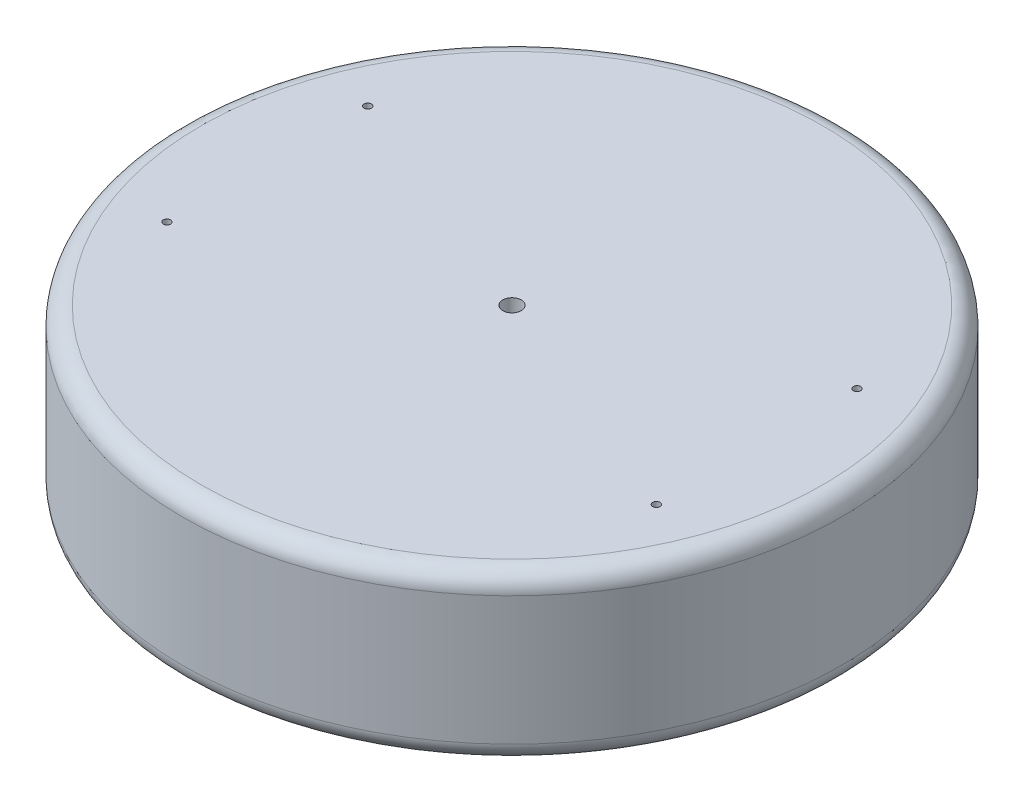
ISO-10303-21;
HEADER;
FILE_DESCRIPTION(('STEP AP214'),'2;1');
FILE_NAME('part.step','',(''),(''),'','','');
FILE_SCHEMA(('AUTOMOTIVE_DESIGN { 1 0 10303 214 1 1 1 1 }'));
ENDSEC;
DATA;
#1=APPLICATION_CONTEXT('core data for automotive mechanical design processes');
#2=APPLICATION_PROTOCOL_DEFINITION('international standard','automotive_design',2000,#1);
#3=PRODUCT_CONTEXT('',#1,'mechanical');
#4=PRODUCT('Part','Part','',(#3));
#5=PRODUCT_RELATED_PRODUCT_CATEGORY('part','',(#4));
#6=PRODUCT_DEFINITION_FORMATION('','',#4);
#7=PRODUCT_DEFINITION_CONTEXT('part definition',#1,'design');
#8=PRODUCT_DEFINITION('design','',#6,#7);
#9=PRODUCT_DEFINITION_SHAPE('','',#8);
#10=(LENGTH_UNIT() NAMED_UNIT(*) SI_UNIT(.MILLI.,.METRE.));
#11=(NAMED_UNIT(*) PLANE_ANGLE_UNIT() SI_UNIT($,.RADIAN.));
#12=(NAMED_UNIT(*) SI_UNIT($,.STERADIAN.) SOLID_ANGLE_UNIT());
#13=UNCERTAINTY_MEASURE_WITH_UNIT(LENGTH_MEASURE(1.E-05),#10,'distance_accuracy_value','');
#14=(GEOMETRIC_REPRESENTATION_CONTEXT(3) GLOBAL_UNCERTAINTY_ASSIGNED_CONTEXT((#13)) GLOBAL_UNIT_ASSIGNED_CONTEXT((#10,
#11,#12)) REPRESENTATION_CONTEXT('',''));
#15=CARTESIAN_POINT('',(0.,0.,0.));
#16=DIRECTION('',(0.,0.,1.));
#17=DIRECTION('',(1.,0.,0.));
#18=AXIS2_PLACEMENT_3D('',#15,#16,#17);
#19=CARTESIAN_POINT('',(0.,89.,0.));
#20=DIRECTION('',(0.,1.,0.));
#21=DIRECTION('',(0.,0.,1.));
#22=AXIS2_PLACEMENT_3D('',#19,#20,#21);
#23=PLANE('',#22);
#24=CARTESIAN_POINT('',(0.,89.,0.));
#25=DIRECTION('',(0.,1.,0.));
#26=DIRECTION('',(0.,0.,1.));
#27=AXIS2_PLACEMENT_3D('',#24,#25,#26);
#28=CIRCLE('',#27,167.);
#29=CARTESIAN_POINT('',(0.,89.,167.));
#30=VERTEX_POINT('',#29);
#31=EDGE_CURVE('E10',#30,#30,#28,.T.);
#32=ORIENTED_EDGE('',*,*,#31,.T.);
#33=EDGE_LOOP('',(#32));
#34=FACE_BOUND('',#33,.T.);
#35=CARTESIAN_POINT('',(-131.4,89.,53.9));
#36=DIRECTION('',(0.,1.,0.));
#37=DIRECTION('',(0.,0.,1.));
#38=AXIS2_PLACEMENT_3D('',#35,#36,#37);
#39=CIRCLE('',#38,1.97500000000001);
#40=CARTESIAN_POINT('',(-131.4,89.,55.875));
#41=VERTEX_POINT('',#40);
#42=EDGE_CURVE('E75',#41,#41,#39,.T.);
#43=ORIENTED_EDGE('',*,*,#42,.F.);
#44=EDGE_LOOP('',(#43));
#45=FACE_BOUND('',#44,.T.);
#46=CARTESIAN_POINT('',(131.4,89.,53.9));
#47=DIRECTION('',(0.,1.,0.));
#48=DIRECTION('',(0.,0.,-1.));
#49=AXIS2_PLACEMENT_3D('',#46,#47,#48);
#50=CIRCLE('',#49,1.97500000000001);
#51=CARTESIAN_POINT('',(131.4,89.,51.925));
#52=VERTEX_POINT('',#51);
#53=EDGE_CURVE('E69',#52,#52,#50,.T.);
#54=ORIENTED_EDGE('',*,*,#53,.F.);
#55=EDGE_LOOP('',(#54));
#56=FACE_BOUND('',#55,.T.);
#57=CARTESIAN_POINT('',(131.4,89.,-53.9));
#58=DIRECTION('',(0.,1.,0.));
#59=DIRECTION('',(0.,0.,-1.));
#60=AXIS2_PLACEMENT_3D('',#57,#58,#59);
#61=CIRCLE('',#60,1.97500000000001);
#62=CARTESIAN_POINT('',(131.4,89.,-55.875));
#63=VERTEX_POINT('',#62);
#64=EDGE_CURVE('E63',#63,#63,#61,.T.);
#65=ORIENTED_EDGE('',*,*,#64,.F.);
#66=EDGE_LOOP('',(#65));
#67=FACE_BOUND('',#66,.T.);
#68=CARTESIAN_POINT('',(-131.4,89.,-53.9));
#69=DIRECTION('',(0.,1.,0.));
#70=DIRECTION('',(0.,0.,1.));
#71=AXIS2_PLACEMENT_3D('',#68,#69,#70);
#72=CIRCLE('',#71,1.97500000000001);
#73=CARTESIAN_POINT('',(-131.4,89.,-51.925));
#74=VERTEX_POINT('',#73);
#75=EDGE_CURVE('E57',#74,#74,#72,.T.);
#76=ORIENTED_EDGE('',*,*,#75,.F.);
#77=EDGE_LOOP('',(#76));
#78=FACE_BOUND('',#77,.T.);
#79=CARTESIAN_POINT('',(0.,89.,0.));
#80=DIRECTION('',(0.,1.,0.));
#81=DIRECTION('',(0.,0.,1.));
#82=AXIS2_PLACEMENT_3D('',#79,#80,#81);
#83=CIRCLE('',#82,5.);
#84=CARTESIAN_POINT('',(0.,89.,5.));
#85=VERTEX_POINT('',#84);
#86=EDGE_CURVE('E50',#85,#85,#83,.T.);
#87=ORIENTED_EDGE('',*,*,#86,.F.);
#88=EDGE_LOOP('',(#87));
#89=FACE_BOUND('',#88,.T.);
#90=ADVANCED_FACE('F30',(#34,#45,#56,#67,#78,#89),#23,.T.);
#91=CARTESIAN_POINT('',(0.,0.,0.));
#92=DIRECTION('',(0.,1.,0.));
#93=DIRECTION('',(0.,0.,1.));
#94=AXIS2_PLACEMENT_3D('',#91,#92,#93);
#95=PLANE('',#94);
#96=CARTESIAN_POINT('',(0.,0.,0.));
#97=DIRECTION('',(0.,1.,0.));
#98=DIRECTION('',(0.,0.,1.));
#99=AXIS2_PLACEMENT_3D('',#96,#97,#98);
#100=CIRCLE('',#99,167.);
#101=CARTESIAN_POINT('',(0.,0.,167.));
#102=VERTEX_POINT('',#101);
#103=EDGE_CURVE('E37',#102,#102,#100,.F.);
#104=ORIENTED_EDGE('',*,*,#103,.T.);
#105=EDGE_LOOP('',(#104));
#106=FACE_BOUND('',#105,.T.);
#107=CARTESIAN_POINT('',(0.,0.,0.));
#108=DIRECTION('',(0.,1.,0.));
#109=DIRECTION('',(0.,0.,1.));
#110=AXIS2_PLACEMENT_3D('',#107,#108,#109);
#111=CIRCLE('',#110,5.);
#112=CARTESIAN_POINT('',(0.,0.,5.));
#113=VERTEX_POINT('',#112);
#114=EDGE_CURVE('E51',#113,#113,#111,.T.);
#115=ORIENTED_EDGE('',*,*,#114,.T.);
#116=EDGE_LOOP('',(#115));
#117=FACE_BOUND('',#116,.T.);
#118=ADVANCED_FACE('F92',(#106,#117),#95,.F.);
#119=CARTESIAN_POINT('',(0.,89.,0.));
#120=DIRECTION('',(0.,-1.,0.));
#121=DIRECTION('',(0.,0.,-1.));
#122=AXIS2_PLACEMENT_3D('',#119,#120,#121);
#123=CYLINDRICAL_SURFACE('',#122,177.);
#124=CARTESIAN_POINT('',(0.,9.99999999999999,0.));
#125=DIRECTION('',(0.,1.,0.));
#126=DIRECTION('',(0.,0.,1.));
#127=AXIS2_PLACEMENT_3D('',#124,#125,#126);
#128=CIRCLE('',#127,177.);
#129=CARTESIAN_POINT('',(0.,9.99999999999999,177.));
#130=VERTEX_POINT('',#129);
#131=EDGE_CURVE('E41',#130,#130,#128,.T.);
#132=ORIENTED_EDGE('',*,*,#131,.T.);
#133=EDGE_LOOP('',(#132));
#134=FACE_BOUND('',#133,.T.);
#135=CARTESIAN_POINT('',(0.,79.,0.));
#136=DIRECTION('',(0.,1.,0.));
#137=DIRECTION('',(0.,0.,1.));
#138=AXIS2_PLACEMENT_3D('',#135,#136,#137);
#139=CIRCLE('',#138,177.);
#140=CARTESIAN_POINT('',(0.,79.,177.));
#141=VERTEX_POINT('',#140);
#142=EDGE_CURVE('E45',#141,#141,#139,.F.);
#143=ORIENTED_EDGE('',*,*,#142,.T.);
#144=EDGE_LOOP('',(#143));
#145=FACE_BOUND('',#144,.T.);
#146=ADVANCED_FACE('F106',(#134,#145),#123,.T.);
#147=CARTESIAN_POINT('',(0.,89.,0.));
#148=DIRECTION('',(0.,-1.,0.));
#149=DIRECTION('',(0.,0.,-1.));
#150=AXIS2_PLACEMENT_3D('',#147,#148,#149);
#151=CYLINDRICAL_SURFACE('',#150,5.);
#152=ORIENTED_EDGE('',*,*,#86,.T.);
#153=EDGE_LOOP('',(#152));
#154=FACE_BOUND('',#153,.T.);
#155=ORIENTED_EDGE('',*,*,#114,.F.);
#156=EDGE_LOOP('',(#155));
#157=FACE_BOUND('',#156,.T.);
#158=ADVANCED_FACE('F102',(#154,#157),#151,.F.);
#159=CARTESIAN_POINT('',(-131.4,70.,-53.9));
#160=DIRECTION('',(0.,1.,0.));
#161=DIRECTION('',(0.,0.,1.));
#162=AXIS2_PLACEMENT_3D('',#159,#160,#161);
#163=CYLINDRICAL_SURFACE('',#162,1.97500000000001);
#164=CARTESIAN_POINT('',(-131.4,70.,-53.9));
#165=DIRECTION('',(0.,1.,0.));
#166=DIRECTION('',(0.,0.,1.));
#167=AXIS2_PLACEMENT_3D('',#164,#165,#166);
#168=CIRCLE('',#167,1.97500000000001);
#169=CARTESIAN_POINT('',(-131.4,70.,-51.925));
#170=VERTEX_POINT('',#169);
#171=EDGE_CURVE('E54',#170,#170,#168,.T.);
#172=ORIENTED_EDGE('',*,*,#171,.F.);
#173=EDGE_LOOP('',(#172));
#174=FACE_BOUND('',#173,.T.);
#175=ORIENTED_EDGE('',*,*,#75,.T.);
#176=EDGE_LOOP('',(#175));
#177=FACE_BOUND('',#176,.T.);
#178=ADVANCED_FACE('F105',(#174,#177),#163,.F.);
#179=CARTESIAN_POINT('',(-131.4,70.,-53.9));
#180=DIRECTION('',(0.,1.,0.));
#181=DIRECTION('',(0.,0.,1.));
#182=AXIS2_PLACEMENT_3D('',#179,#180,#181);
#183=PLANE('',#182);
#184=ORIENTED_EDGE('',*,*,#171,.T.);
#185=EDGE_LOOP('',(#184));
#186=FACE_BOUND('',#185,.T.);
#187=ADVANCED_FACE('F148',(#186),#183,.T.);
#188=CARTESIAN_POINT('',(131.4,70.,-53.9));
#189=DIRECTION('',(0.,1.,0.));
#190=DIRECTION('',(0.,0.,1.));
#191=AXIS2_PLACEMENT_3D('',#188,#189,#190);
#192=CYLINDRICAL_SURFACE('',#191,1.97500000000001);
#193=CARTESIAN_POINT('',(131.4,70.,-53.9));
#194=DIRECTION('',(0.,1.,0.));
#195=DIRECTION('',(0.,0.,-1.));
#196=AXIS2_PLACEMENT_3D('',#193,#194,#195);
#197=CIRCLE('',#196,1.97500000000001);
#198=CARTESIAN_POINT('',(131.4,70.,-55.875));
#199=VERTEX_POINT('',#198);
#200=EDGE_CURVE('E66',#199,#199,#197,.T.);
#201=ORIENTED_EDGE('',*,*,#200,.F.);
#202=EDGE_LOOP('',(#201));
#203=FACE_BOUND('',#202,.T.);
#204=ORIENTED_EDGE('',*,*,#64,.T.);
#205=EDGE_LOOP('',(#204));
#206=FACE_BOUND('',#205,.T.);
#207=ADVANCED_FACE('F144',(#203,#206),#192,.F.);
#208=CARTESIAN_POINT('',(131.4,70.,-53.9));
#209=DIRECTION('',(0.,-1.,0.));
#210=DIRECTION('',(0.,0.,-1.));
#211=AXIS2_PLACEMENT_3D('',#208,#209,#210);
#212=PLANE('',#211);
#213=ORIENTED_EDGE('',*,*,#200,.T.);
#214=EDGE_LOOP('',(#213));
#215=FACE_BOUND('',#214,.T.);
#216=ADVANCED_FACE('F140',(#215),#212,.F.);
#217=CARTESIAN_POINT('',(131.4,70.,53.9));
#218=DIRECTION('',(0.,1.,0.));
#219=DIRECTION('',(0.,0.,1.));
#220=AXIS2_PLACEMENT_3D('',#217,#218,#219);
#221=CYLINDRICAL_SURFACE('',#220,1.97500000000001);
#222=CARTESIAN_POINT('',(131.4,70.,53.9));
#223=DIRECTION('',(0.,1.,0.));
#224=DIRECTION('',(0.,0.,-1.));
#225=AXIS2_PLACEMENT_3D('',#222,#223,#224);
#226=CIRCLE('',#225,1.97500000000001);
#227=CARTESIAN_POINT('',(131.4,70.,51.925));
#228=VERTEX_POINT('',#227);
#229=EDGE_CURVE('E72',#228,#228,#226,.T.);
#230=ORIENTED_EDGE('',*,*,#229,.F.);
#231=EDGE_LOOP('',(#230));
#232=FACE_BOUND('',#231,.T.);
#233=ORIENTED_EDGE('',*,*,#53,.T.);
#234=EDGE_LOOP('',(#233));
#235=FACE_BOUND('',#234,.T.);
#236=ADVANCED_FACE('F136',(#232,#235),#221,.F.);
#237=CARTESIAN_POINT('',(131.4,70.,53.9));
#238=DIRECTION('',(0.,-1.,0.));
#239=DIRECTION('',(0.,0.,-1.));
#240=AXIS2_PLACEMENT_3D('',#237,#238,#239);
#241=PLANE('',#240);
#242=ORIENTED_EDGE('',*,*,#229,.T.);
#243=EDGE_LOOP('',(#242));
#244=FACE_BOUND('',#243,.T.);
#245=ADVANCED_FACE('F86',(#244),#241,.F.);
#246=CARTESIAN_POINT('',(-131.4,70.,53.9));
#247=DIRECTION('',(0.,1.,0.));
#248=DIRECTION('',(0.,0.,1.));
#249=AXIS2_PLACEMENT_3D('',#246,#247,#248);
#250=CYLINDRICAL_SURFACE('',#249,1.97500000000001);
#251=CARTESIAN_POINT('',(-131.4,70.,53.9));
#252=DIRECTION('',(0.,1.,0.));
#253=DIRECTION('',(0.,0.,1.));
#254=AXIS2_PLACEMENT_3D('',#251,#252,#253);
#255=CIRCLE('',#254,1.97500000000001);
#256=CARTESIAN_POINT('',(-131.4,70.,55.875));
#257=VERTEX_POINT('',#256);
#258=EDGE_CURVE('E60',#257,#257,#255,.T.);
#259=ORIENTED_EDGE('',*,*,#258,.F.);
#260=EDGE_LOOP('',(#259));
#261=FACE_BOUND('',#260,.T.);
#262=ORIENTED_EDGE('',*,*,#42,.T.);
#263=EDGE_LOOP('',(#262));
#264=FACE_BOUND('',#263,.T.);
#265=ADVANCED_FACE('F83',(#261,#264),#250,.F.);
#266=CARTESIAN_POINT('',(-131.4,70.,53.9));
#267=DIRECTION('',(0.,1.,0.));
#268=DIRECTION('',(0.,0.,1.));
#269=AXIS2_PLACEMENT_3D('',#266,#267,#268);
#270=PLANE('',#269);
#271=ORIENTED_EDGE('',*,*,#258,.T.);
#272=EDGE_LOOP('',(#271));
#273=FACE_BOUND('',#272,.T.);
#274=ADVANCED_FACE('F81',(#273),#270,.T.);
#275=CARTESIAN_POINT('',(0.,9.99999999999999,0.));
#276=DIRECTION('',(0.,1.,0.));
#277=DIRECTION('',(0.,0.,1.));
#278=AXIS2_PLACEMENT_3D('',#275,#276,#277);
#279=TOROIDAL_SURFACE('',#278,167.,10.);
#280=ORIENTED_EDGE('',*,*,#103,.F.);
#281=EDGE_LOOP('',(#280));
#282=FACE_BOUND('',#281,.T.);
#283=ORIENTED_EDGE('',*,*,#131,.F.);
#284=EDGE_LOOP('',(#283));
#285=FACE_BOUND('',#284,.T.);
#286=ADVANCED_FACE('F117',(#282,#285),#279,.T.);
#287=CARTESIAN_POINT('',(0.,79.,0.));
#288=DIRECTION('',(0.,1.,0.));
#289=DIRECTION('',(0.,0.,1.));
#290=AXIS2_PLACEMENT_3D('',#287,#288,#289);
#291=TOROIDAL_SURFACE('',#290,167.,10.);
#292=ORIENTED_EDGE('',*,*,#142,.F.);
#293=EDGE_LOOP('',(#292));
#294=FACE_BOUND('',#293,.T.);
#295=ORIENTED_EDGE('',*,*,#31,.F.);
#296=EDGE_LOOP('',(#295));
#297=FACE_BOUND('',#296,.T.);
#298=ADVANCED_FACE('F32',(#294,#297),#291,.T.);
#299=CLOSED_SHELL('',(#90,#118,#146,#158,#178,#187,#207,#216,#236,#245,#265,#274,#286,#298));
#300=MANIFOLD_SOLID_BREP('B2',#299);
#301=ADVANCED_BREP_SHAPE_REPRESENTATION('',(#18,#300),#14);
#302=SHAPE_DEFINITION_REPRESENTATION(#9,#301);
ENDSEC;
END-ISO-10303-21;
